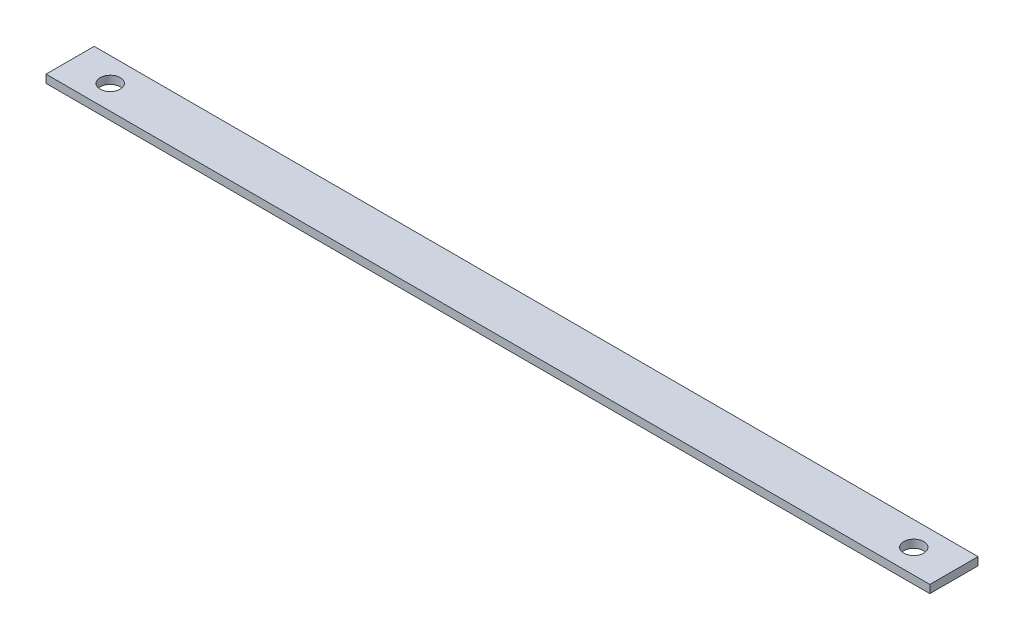
ISO-10303-21;
HEADER;
FILE_DESCRIPTION(('STEP AP214'),'2;1');
FILE_NAME('part.step','',(''),(''),'','','');
FILE_SCHEMA(('AUTOMOTIVE_DESIGN { 1 0 10303 214 1 1 1 1 }'));
ENDSEC;
DATA;
#1=APPLICATION_CONTEXT('core data for automotive mechanical design processes');
#2=APPLICATION_PROTOCOL_DEFINITION('international standard','automotive_design',2000,#1);
#3=PRODUCT_CONTEXT('',#1,'mechanical');
#4=PRODUCT('Part','Part','',(#3));
#5=PRODUCT_RELATED_PRODUCT_CATEGORY('part','',(#4));
#6=PRODUCT_DEFINITION_FORMATION('','',#4);
#7=PRODUCT_DEFINITION_CONTEXT('part definition',#1,'design');
#8=PRODUCT_DEFINITION('design','',#6,#7);
#9=PRODUCT_DEFINITION_SHAPE('','',#8);
#10=(LENGTH_UNIT() NAMED_UNIT(*) SI_UNIT(.MILLI.,.METRE.));
#11=(NAMED_UNIT(*) PLANE_ANGLE_UNIT() SI_UNIT($,.RADIAN.));
#12=(NAMED_UNIT(*) SI_UNIT($,.STERADIAN.) SOLID_ANGLE_UNIT());
#13=UNCERTAINTY_MEASURE_WITH_UNIT(LENGTH_MEASURE(1.E-05),#10,'distance_accuracy_value','');
#14=(GEOMETRIC_REPRESENTATION_CONTEXT(3) GLOBAL_UNCERTAINTY_ASSIGNED_CONTEXT((#13)) GLOBAL_UNIT_ASSIGNED_CONTEXT((#10,
#11,#12)) REPRESENTATION_CONTEXT('',''));
#15=CARTESIAN_POINT('',(0.,0.,0.));
#16=DIRECTION('',(0.,0.,1.));
#17=DIRECTION('',(1.,0.,0.));
#18=AXIS2_PLACEMENT_3D('',#15,#16,#17);
#19=CARTESIAN_POINT('',(110.093615,2.,6.));
#20=DIRECTION('',(-1.,0.,0.));
#21=DIRECTION('',(0.,0.,1.));
#22=AXIS2_PLACEMENT_3D('',#19,#20,#21);
#23=PLANE('',#22);
#24=DIRECTION('',(0.,0.,-1.));
#25=VECTOR('',#24,1.);
#26=CARTESIAN_POINT('',(110.093615,0.,6.));
#27=LINE('',#26,#25);
#28=CARTESIAN_POINT('',(110.093615,0.,6.));
#29=VERTEX_POINT('',#28);
#30=CARTESIAN_POINT('',(110.093615,0.,-6.));
#31=VERTEX_POINT('',#30);
#32=EDGE_CURVE('E96',#29,#31,#27,.T.);
#33=ORIENTED_EDGE('',*,*,#32,.T.);
#34=DIRECTION('',(0.,-1.,0.));
#35=VECTOR('',#34,1.);
#36=CARTESIAN_POINT('',(110.093615,2.,-6.));
#37=LINE('',#36,#35);
#38=CARTESIAN_POINT('',(110.093615,2.,-6.));
#39=VERTEX_POINT('',#38);
#40=EDGE_CURVE('E11',#39,#31,#37,.T.);
#41=ORIENTED_EDGE('',*,*,#40,.F.);
#42=DIRECTION('',(0.,0.,-1.));
#43=VECTOR('',#42,1.);
#44=CARTESIAN_POINT('',(110.093615,2.,6.));
#45=LINE('',#44,#43);
#46=CARTESIAN_POINT('',(110.093615,2.,6.));
#47=VERTEX_POINT('',#46);
#48=EDGE_CURVE('E84',#47,#39,#45,.T.);
#49=ORIENTED_EDGE('',*,*,#48,.F.);
#50=DIRECTION('',(0.,-1.,0.));
#51=VECTOR('',#50,1.);
#52=CARTESIAN_POINT('',(110.093615,2.,6.));
#53=LINE('',#52,#51);
#54=EDGE_CURVE('E92',#47,#29,#53,.T.);
#55=ORIENTED_EDGE('',*,*,#54,.T.);
#56=EDGE_LOOP('',(#33,#41,#49,#55));
#57=FACE_BOUND('',#56,.T.);
#58=ADVANCED_FACE('F33',(#57),#23,.F.);
#59=CARTESIAN_POINT('',(-110.093615,2.,-6.));
#60=DIRECTION('',(0.,0.,1.));
#61=DIRECTION('',(1.,0.,0.));
#62=AXIS2_PLACEMENT_3D('',#59,#60,#61);
#63=PLANE('',#62);
#64=DIRECTION('',(-1.,0.,0.));
#65=VECTOR('',#64,1.);
#66=CARTESIAN_POINT('',(-110.093615,0.,-6.));
#67=LINE('',#66,#65);
#68=CARTESIAN_POINT('',(-110.093615,0.,-6.));
#69=VERTEX_POINT('',#68);
#70=EDGE_CURVE('E88',#31,#69,#67,.T.);
#71=ORIENTED_EDGE('',*,*,#70,.T.);
#72=DIRECTION('',(0.,-1.,0.));
#73=VECTOR('',#72,1.);
#74=CARTESIAN_POINT('',(-110.093615,2.,-6.));
#75=LINE('',#74,#73);
#76=CARTESIAN_POINT('',(-110.093615,2.,-6.));
#77=VERTEX_POINT('',#76);
#78=EDGE_CURVE('E41',#77,#69,#75,.T.);
#79=ORIENTED_EDGE('',*,*,#78,.F.);
#80=DIRECTION('',(-1.,0.,0.));
#81=VECTOR('',#80,1.);
#82=CARTESIAN_POINT('',(-110.093615,2.,-6.));
#83=LINE('',#82,#81);
#84=EDGE_CURVE('E79',#39,#77,#83,.T.);
#85=ORIENTED_EDGE('',*,*,#84,.F.);
#86=ORIENTED_EDGE('',*,*,#40,.T.);
#87=EDGE_LOOP('',(#71,#79,#85,#86));
#88=FACE_BOUND('',#87,.T.);
#89=ADVANCED_FACE('F87',(#88),#63,.F.);
#90=CARTESIAN_POINT('',(-110.093615,2.,6.));
#91=DIRECTION('',(1.,0.,0.));
#92=DIRECTION('',(0.,0.,-1.));
#93=AXIS2_PLACEMENT_3D('',#90,#91,#92);
#94=PLANE('',#93);
#95=DIRECTION('',(0.,0.,1.));
#96=VECTOR('',#95,1.);
#97=CARTESIAN_POINT('',(-110.093615,0.,6.));
#98=LINE('',#97,#96);
#99=CARTESIAN_POINT('',(-110.093615,0.,6.));
#100=VERTEX_POINT('',#99);
#101=EDGE_CURVE('E66',#69,#100,#98,.T.);
#102=ORIENTED_EDGE('',*,*,#101,.T.);
#103=DIRECTION('',(0.,-1.,0.));
#104=VECTOR('',#103,1.);
#105=CARTESIAN_POINT('',(-110.093615,2.,6.));
#106=LINE('',#105,#104);
#107=CARTESIAN_POINT('',(-110.093615,2.,6.));
#108=VERTEX_POINT('',#107);
#109=EDGE_CURVE('E89',#108,#100,#106,.T.);
#110=ORIENTED_EDGE('',*,*,#109,.F.);
#111=DIRECTION('',(0.,0.,1.));
#112=VECTOR('',#111,1.);
#113=CARTESIAN_POINT('',(-110.093615,2.,6.));
#114=LINE('',#113,#112);
#115=EDGE_CURVE('E82',#77,#108,#114,.T.);
#116=ORIENTED_EDGE('',*,*,#115,.F.);
#117=ORIENTED_EDGE('',*,*,#78,.T.);
#118=EDGE_LOOP('',(#102,#110,#116,#117));
#119=FACE_BOUND('',#118,.T.);
#120=ADVANCED_FACE('F90',(#119),#94,.F.);
#121=CARTESIAN_POINT('',(-110.093615,2.,6.));
#122=DIRECTION('',(0.,0.,-1.));
#123=DIRECTION('',(-1.,0.,0.));
#124=AXIS2_PLACEMENT_3D('',#121,#122,#123);
#125=PLANE('',#124);
#126=DIRECTION('',(1.,0.,0.));
#127=VECTOR('',#126,1.);
#128=CARTESIAN_POINT('',(-110.093615,0.,6.));
#129=LINE('',#128,#127);
#130=EDGE_CURVE('E72',#100,#29,#129,.T.);
#131=ORIENTED_EDGE('',*,*,#130,.T.);
#132=ORIENTED_EDGE('',*,*,#54,.F.);
#133=DIRECTION('',(1.,0.,0.));
#134=VECTOR('',#133,1.);
#135=CARTESIAN_POINT('',(-110.093615,2.,6.));
#136=LINE('',#135,#134);
#137=EDGE_CURVE('E49',#108,#47,#136,.T.);
#138=ORIENTED_EDGE('',*,*,#137,.F.);
#139=ORIENTED_EDGE('',*,*,#109,.T.);
#140=EDGE_LOOP('',(#131,#132,#138,#139));
#141=FACE_BOUND('',#140,.T.);
#142=ADVANCED_FACE('F104',(#141),#125,.F.);
#143=CARTESIAN_POINT('',(0.,2.,0.));
#144=DIRECTION('',(0.,-1.,0.));
#145=DIRECTION('',(0.,0.,-1.));
#146=AXIS2_PLACEMENT_3D('',#143,#144,#145);
#147=PLANE('',#146);
#148=CARTESIAN_POINT('',(-100.093615,2.,0.));
#149=DIRECTION('',(0.,1.,0.));
#150=DIRECTION('',(0.,0.,1.));
#151=AXIS2_PLACEMENT_3D('',#148,#149,#150);
#152=CIRCLE('',#151,2.5);
#153=CARTESIAN_POINT('',(-100.093615,2.,2.50000000000003));
#154=VERTEX_POINT('',#153);
#155=EDGE_CURVE('E118',#154,#154,#152,.T.);
#156=ORIENTED_EDGE('',*,*,#155,.F.);
#157=EDGE_LOOP('',(#156));
#158=FACE_BOUND('',#157,.T.);
#159=CARTESIAN_POINT('',(100.093615,2.,0.));
#160=DIRECTION('',(0.,1.,0.));
#161=DIRECTION('',(0.,0.,1.));
#162=AXIS2_PLACEMENT_3D('',#159,#160,#161);
#163=CIRCLE('',#162,2.5);
#164=CARTESIAN_POINT('',(100.093615,2.,2.5));
#165=VERTEX_POINT('',#164);
#166=EDGE_CURVE('E112',#165,#165,#163,.T.);
#167=ORIENTED_EDGE('',*,*,#166,.F.);
#168=EDGE_LOOP('',(#167));
#169=FACE_BOUND('',#168,.T.);
#170=ORIENTED_EDGE('',*,*,#48,.T.);
#171=ORIENTED_EDGE('',*,*,#84,.T.);
#172=ORIENTED_EDGE('',*,*,#115,.T.);
#173=ORIENTED_EDGE('',*,*,#137,.T.);
#174=EDGE_LOOP('',(#170,#171,#172,#173));
#175=FACE_BOUND('',#174,.T.);
#176=ADVANCED_FACE('F80',(#158,#169,#175),#147,.F.);
#177=CARTESIAN_POINT('',(0.,0.,0.));
#178=DIRECTION('',(0.,-1.,0.));
#179=DIRECTION('',(0.,0.,-1.));
#180=AXIS2_PLACEMENT_3D('',#177,#178,#179);
#181=PLANE('',#180);
#182=CARTESIAN_POINT('',(-100.093615,0.,0.));
#183=DIRECTION('',(0.,-1.,0.));
#184=DIRECTION('',(0.,0.,-1.));
#185=AXIS2_PLACEMENT_3D('',#182,#183,#184);
#186=CIRCLE('',#185,2.5);
#187=CARTESIAN_POINT('',(-100.093615,0.,-2.49999999999998));
#188=VERTEX_POINT('',#187);
#189=EDGE_CURVE('E115',#188,#188,#186,.T.);
#190=ORIENTED_EDGE('',*,*,#189,.F.);
#191=EDGE_LOOP('',(#190));
#192=FACE_BOUND('',#191,.T.);
#193=CARTESIAN_POINT('',(100.093615,0.,0.));
#194=DIRECTION('',(0.,-1.,0.));
#195=DIRECTION('',(0.,0.,-1.));
#196=AXIS2_PLACEMENT_3D('',#193,#194,#195);
#197=CIRCLE('',#196,2.5);
#198=CARTESIAN_POINT('',(100.093615,0.,-2.5));
#199=VERTEX_POINT('',#198);
#200=EDGE_CURVE('E99',#199,#199,#197,.T.);
#201=ORIENTED_EDGE('',*,*,#200,.F.);
#202=EDGE_LOOP('',(#201));
#203=FACE_BOUND('',#202,.T.);
#204=ORIENTED_EDGE('',*,*,#32,.F.);
#205=ORIENTED_EDGE('',*,*,#130,.F.);
#206=ORIENTED_EDGE('',*,*,#101,.F.);
#207=ORIENTED_EDGE('',*,*,#70,.F.);
#208=EDGE_LOOP('',(#204,#205,#206,#207));
#209=FACE_BOUND('',#208,.T.);
#210=ADVANCED_FACE('F107',(#192,#203,#209),#181,.T.);
#211=CARTESIAN_POINT('',(100.093615,2.,0.));
#212=DIRECTION('',(0.,1.,0.));
#213=DIRECTION('',(0.,0.,1.));
#214=AXIS2_PLACEMENT_3D('',#211,#212,#213);
#215=CYLINDRICAL_SURFACE('',#214,2.5);
#216=ORIENTED_EDGE('',*,*,#166,.T.);
#217=EDGE_LOOP('',(#216));
#218=FACE_BOUND('',#217,.T.);
#219=ORIENTED_EDGE('',*,*,#200,.T.);
#220=EDGE_LOOP('',(#219));
#221=FACE_BOUND('',#220,.T.);
#222=ADVANCED_FACE('F130',(#218,#221),#215,.F.);
#223=CARTESIAN_POINT('',(-100.093615,2.,0.));
#224=DIRECTION('',(0.,1.,0.));
#225=DIRECTION('',(0.,0.,1.));
#226=AXIS2_PLACEMENT_3D('',#223,#224,#225);
#227=CYLINDRICAL_SURFACE('',#226,2.5);
#228=ORIENTED_EDGE('',*,*,#155,.T.);
#229=EDGE_LOOP('',(#228));
#230=FACE_BOUND('',#229,.T.);
#231=ORIENTED_EDGE('',*,*,#189,.T.);
#232=EDGE_LOOP('',(#231));
#233=FACE_BOUND('',#232,.T.);
#234=ADVANCED_FACE('F122',(#230,#233),#227,.F.);
#235=CLOSED_SHELL('',(#58,#89,#120,#142,#176,#210,#222,#234));
#236=MANIFOLD_SOLID_BREP('B2',#235);
#237=ADVANCED_BREP_SHAPE_REPRESENTATION('',(#18,#236),#14);
#238=SHAPE_DEFINITION_REPRESENTATION(#9,#237);
ENDSEC;
END-ISO-10303-21;
